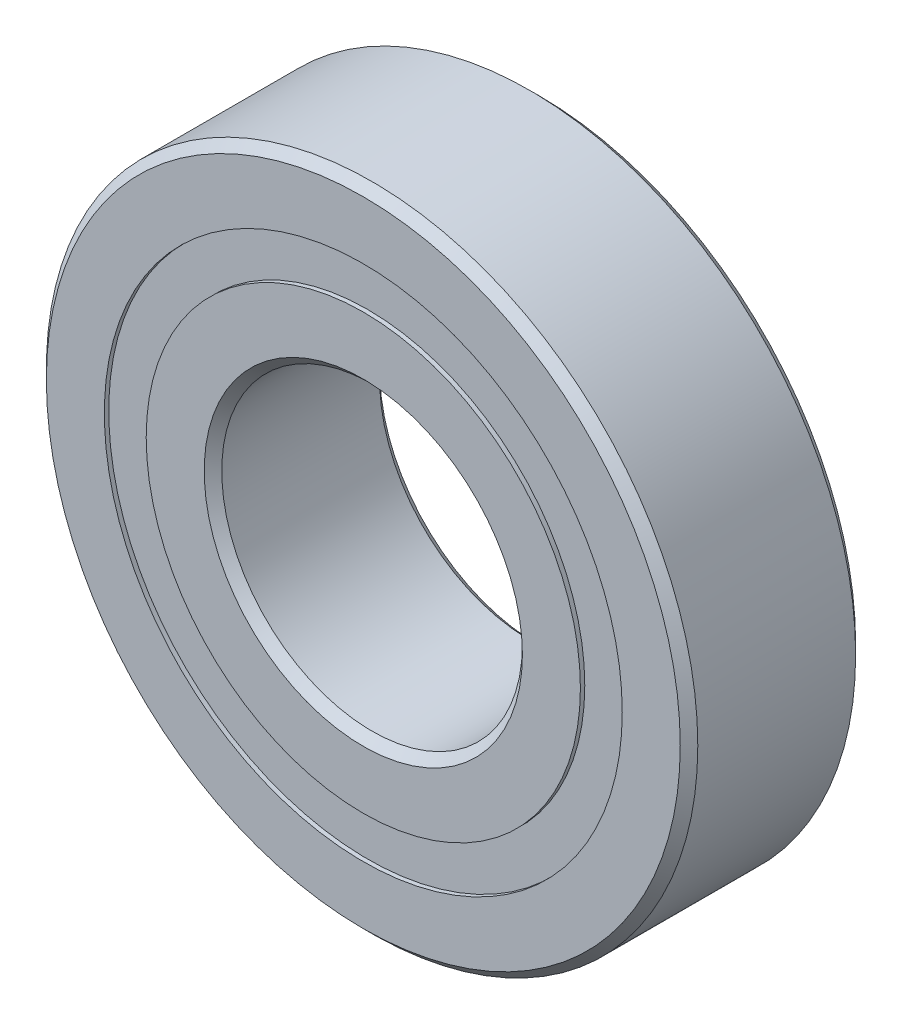
ISO-10303-21;
HEADER;
FILE_DESCRIPTION(('STEP AP214'),'2;1');
FILE_NAME('part.step','',(''),(''),'','','');
FILE_SCHEMA(('AUTOMOTIVE_DESIGN { 1 0 10303 214 1 1 1 1 }'));
ENDSEC;
DATA;
#1=APPLICATION_CONTEXT('core data for automotive mechanical design processes');
#2=APPLICATION_PROTOCOL_DEFINITION('international standard','automotive_design',2000,#1);
#3=PRODUCT_CONTEXT('',#1,'mechanical');
#4=PRODUCT('Part','Part','',(#3));
#5=PRODUCT_RELATED_PRODUCT_CATEGORY('part','',(#4));
#6=PRODUCT_DEFINITION_FORMATION('','',#4);
#7=PRODUCT_DEFINITION_CONTEXT('part definition',#1,'design');
#8=PRODUCT_DEFINITION('design','',#6,#7);
#9=PRODUCT_DEFINITION_SHAPE('','',#8);
#10=(LENGTH_UNIT() NAMED_UNIT(*) SI_UNIT(.MILLI.,.METRE.));
#11=(NAMED_UNIT(*) PLANE_ANGLE_UNIT() SI_UNIT($,.RADIAN.));
#12=(NAMED_UNIT(*) SI_UNIT($,.STERADIAN.) SOLID_ANGLE_UNIT());
#13=UNCERTAINTY_MEASURE_WITH_UNIT(LENGTH_MEASURE(1.E-05),#10,'distance_accuracy_value','');
#14=(GEOMETRIC_REPRESENTATION_CONTEXT(3) GLOBAL_UNCERTAINTY_ASSIGNED_CONTEXT((#13)) GLOBAL_UNIT_ASSIGNED_CONTEXT((#10,
#11,#12)) REPRESENTATION_CONTEXT('',''));
#15=CARTESIAN_POINT('',(0.,0.,0.));
#16=DIRECTION('',(0.,0.,1.));
#17=DIRECTION('',(1.,0.,0.));
#18=AXIS2_PLACEMENT_3D('',#15,#16,#17);
#19=CARTESIAN_POINT('',(0.,16.4070741758242,-5.2784375));
#20=DIRECTION('',(0.,0.,1.));
#21=DIRECTION('',(1.,0.,0.));
#22=AXIS2_PLACEMENT_3D('',#19,#20,#21);
#23=PLANE('',#22);
#24=CARTESIAN_POINT('',(0.,0.,-5.2784375));
#25=DIRECTION('',(0.,0.,1.));
#26=DIRECTION('',(1.,0.,0.));
#27=AXIS2_PLACEMENT_3D('',#24,#25,#26);
#28=CIRCLE('',#27,16.4070741758242);
#29=CARTESIAN_POINT('',(16.4070741758242,0.,-5.2784375));
#30=VERTEX_POINT('',#29);
#31=EDGE_CURVE('E72',#30,#30,#28,.T.);
#32=ORIENTED_EDGE('',*,*,#31,.F.);
#33=EDGE_LOOP('',(#32));
#34=FACE_BOUND('',#33,.T.);
#35=CARTESIAN_POINT('',(0.,0.,-5.2784375));
#36=DIRECTION('',(0.,0.,1.));
#37=DIRECTION('',(1.,0.,0.));
#38=AXIS2_PLACEMENT_3D('',#35,#36,#37);
#39=CIRCLE('',#38,13.7554258241758);
#40=CARTESIAN_POINT('',(13.7554258241758,0.,-5.2784375));
#41=VERTEX_POINT('',#40);
#42=EDGE_CURVE('E13',#41,#41,#39,.T.);
#43=ORIENTED_EDGE('',*,*,#42,.T.);
#44=EDGE_LOOP('',(#43));
#45=FACE_BOUND('',#44,.T.);
#46=ADVANCED_FACE('F58',(#34,#45),#23,.F.);
#47=CARTESIAN_POINT('',(0.,0.,5.55625));
#48=DIRECTION('',(0.,0.,1.));
#49=DIRECTION('',(1.,0.,0.));
#50=AXIS2_PLACEMENT_3D('',#47,#48,#49);
#51=CYLINDRICAL_SURFACE('',#50,13.7554258241758);
#52=ORIENTED_EDGE('',*,*,#42,.F.);
#53=EDGE_LOOP('',(#52));
#54=FACE_BOUND('',#53,.T.);
#55=CARTESIAN_POINT('',(0.,0.,-2.80284955168796));
#56=DIRECTION('',(0.,0.,1.));
#57=DIRECTION('',(1.,0.,0.));
#58=AXIS2_PLACEMENT_3D('',#55,#56,#57);
#59=CIRCLE('',#58,13.7554258241758);
#60=CARTESIAN_POINT('',(13.7554258241758,0.,-2.80284955168796));
#61=VERTEX_POINT('',#60);
#62=EDGE_CURVE('E64',#61,#61,#59,.T.);
#63=ORIENTED_EDGE('',*,*,#62,.T.);
#64=EDGE_LOOP('',(#63));
#65=FACE_BOUND('',#64,.T.);
#66=ADVANCED_FACE('F81',(#54,#65),#51,.F.);
#67=CARTESIAN_POINT('',(0.,16.4070741758242,-2.80284955168796));
#68=DIRECTION('',(0.,0.,-1.));
#69=DIRECTION('',(-1.,0.,0.));
#70=AXIS2_PLACEMENT_3D('',#67,#68,#69);
#71=PLANE('',#70);
#72=ORIENTED_EDGE('',*,*,#62,.F.);
#73=EDGE_LOOP('',(#72));
#74=FACE_BOUND('',#73,.T.);
#75=CARTESIAN_POINT('',(0.,0.,-2.80284955168796));
#76=DIRECTION('',(0.,0.,1.));
#77=DIRECTION('',(1.,0.,0.));
#78=AXIS2_PLACEMENT_3D('',#75,#76,#77);
#79=CIRCLE('',#78,16.4070741758242);
#80=CARTESIAN_POINT('',(16.4070741758242,0.,-2.80284955168796));
#81=VERTEX_POINT('',#80);
#82=EDGE_CURVE('E68',#81,#81,#79,.T.);
#83=ORIENTED_EDGE('',*,*,#82,.T.);
#84=EDGE_LOOP('',(#83));
#85=FACE_BOUND('',#84,.T.);
#86=ADVANCED_FACE('F85',(#74,#85),#71,.F.);
#87=CARTESIAN_POINT('',(0.,0.,5.55625));
#88=DIRECTION('',(0.,0.,1.));
#89=DIRECTION('',(1.,0.,0.));
#90=AXIS2_PLACEMENT_3D('',#87,#88,#89);
#91=CYLINDRICAL_SURFACE('',#90,16.4070741758242);
#92=ORIENTED_EDGE('',*,*,#82,.F.);
#93=EDGE_LOOP('',(#92));
#94=FACE_BOUND('',#93,.T.);
#95=ORIENTED_EDGE('',*,*,#31,.T.);
#96=EDGE_LOOP('',(#95));
#97=FACE_BOUND('',#96,.T.);
#98=ADVANCED_FACE('F78',(#94,#97),#91,.T.);
#99=CLOSED_SHELL('',(#46,#66,#86,#98));
#100=MANIFOLD_SOLID_BREP('B2',#99);
#101=CARTESIAN_POINT('',(0.,16.4070741758242,5.2784375));
#102=DIRECTION('',(0.,0.,-1.));
#103=DIRECTION('',(-1.,0.,0.));
#104=AXIS2_PLACEMENT_3D('',#101,#102,#103);
#105=PLANE('',#104);
#106=CARTESIAN_POINT('',(0.,0.,5.2784375));
#107=DIRECTION('',(0.,0.,1.));
#108=DIRECTION('',(1.,0.,0.));
#109=AXIS2_PLACEMENT_3D('',#106,#107,#108);
#110=CIRCLE('',#109,13.7554258241758);
#111=CARTESIAN_POINT('',(13.7554258241758,0.,5.2784375));
#112=VERTEX_POINT('',#111);
#113=EDGE_CURVE('E57',#112,#112,#110,.T.);
#114=ORIENTED_EDGE('',*,*,#113,.F.);
#115=EDGE_LOOP('',(#114));
#116=FACE_BOUND('',#115,.T.);
#117=CARTESIAN_POINT('',(0.,0.,5.2784375));
#118=DIRECTION('',(0.,0.,1.));
#119=DIRECTION('',(1.,0.,0.));
#120=AXIS2_PLACEMENT_3D('',#117,#118,#119);
#121=CIRCLE('',#120,16.4070741758242);
#122=CARTESIAN_POINT('',(16.4070741758242,0.,5.2784375));
#123=VERTEX_POINT('',#122);
#124=EDGE_CURVE('E147',#123,#123,#121,.T.);
#125=ORIENTED_EDGE('',*,*,#124,.T.);
#126=EDGE_LOOP('',(#125));
#127=FACE_BOUND('',#126,.T.);
#128=ADVANCED_FACE('F133',(#116,#127),#105,.F.);
#129=CARTESIAN_POINT('',(0.,0.,5.55625));
#130=DIRECTION('',(0.,0.,1.));
#131=DIRECTION('',(1.,0.,0.));
#132=AXIS2_PLACEMENT_3D('',#129,#130,#131);
#133=CYLINDRICAL_SURFACE('',#132,13.7554258241758);
#134=CARTESIAN_POINT('',(0.,0.,2.80284955168796));
#135=DIRECTION('',(0.,0.,1.));
#136=DIRECTION('',(1.,0.,0.));
#137=AXIS2_PLACEMENT_3D('',#134,#135,#136);
#138=CIRCLE('',#137,13.7554258241758);
#139=CARTESIAN_POINT('',(13.7554258241758,0.,2.80284955168796));
#140=VERTEX_POINT('',#139);
#141=EDGE_CURVE('E139',#140,#140,#138,.T.);
#142=ORIENTED_EDGE('',*,*,#141,.F.);
#143=EDGE_LOOP('',(#142));
#144=FACE_BOUND('',#143,.T.);
#145=ORIENTED_EDGE('',*,*,#113,.T.);
#146=EDGE_LOOP('',(#145));
#147=FACE_BOUND('',#146,.T.);
#148=ADVANCED_FACE('F162',(#144,#147),#133,.F.);
#149=CARTESIAN_POINT('',(0.,16.4070741758242,2.80284955168796));
#150=DIRECTION('',(0.,0.,1.));
#151=DIRECTION('',(1.,0.,0.));
#152=AXIS2_PLACEMENT_3D('',#149,#150,#151);
#153=PLANE('',#152);
#154=CARTESIAN_POINT('',(0.,0.,2.80284955168796));
#155=DIRECTION('',(0.,0.,1.));
#156=DIRECTION('',(1.,0.,0.));
#157=AXIS2_PLACEMENT_3D('',#154,#155,#156);
#158=CIRCLE('',#157,16.4070741758242);
#159=CARTESIAN_POINT('',(16.4070741758242,0.,2.80284955168796));
#160=VERTEX_POINT('',#159);
#161=EDGE_CURVE('E143',#160,#160,#158,.T.);
#162=ORIENTED_EDGE('',*,*,#161,.F.);
#163=EDGE_LOOP('',(#162));
#164=FACE_BOUND('',#163,.T.);
#165=ORIENTED_EDGE('',*,*,#141,.T.);
#166=EDGE_LOOP('',(#165));
#167=FACE_BOUND('',#166,.T.);
#168=ADVANCED_FACE('F157',(#164,#167),#153,.F.);
#169=CARTESIAN_POINT('',(0.,0.,5.55625));
#170=DIRECTION('',(0.,0.,1.));
#171=DIRECTION('',(1.,0.,0.));
#172=AXIS2_PLACEMENT_3D('',#169,#170,#171);
#173=CYLINDRICAL_SURFACE('',#172,16.4070741758242);
#174=ORIENTED_EDGE('',*,*,#124,.F.);
#175=EDGE_LOOP('',(#174));
#176=FACE_BOUND('',#175,.T.);
#177=ORIENTED_EDGE('',*,*,#161,.T.);
#178=EDGE_LOOP('',(#177));
#179=FACE_BOUND('',#178,.T.);
#180=ADVANCED_FACE('F154',(#176,#179),#173,.T.);
#181=CLOSED_SHELL('',(#128,#148,#168,#180));
#182=MANIFOLD_SOLID_BREP('B8',#181);
#183=CARTESIAN_POINT('',(-7.54062499999983,13.0607456208242,0.));
#184=DIRECTION('',(0.,0.,1.));
#185=DIRECTION('',(-0.499999999999989,0.866025403784445,0.));
#186=AXIS2_PLACEMENT_3D('',#183,#184,#185);
#187=SPHERICAL_SURFACE('',#186,2.80284955168796);
#188=CARTESIAN_POINT('',(-7.54062499999983,13.0607456208242,2.80284955168796));
#189=VERTEX_POINT('',#188);
#190=VERTEX_LOOP('',#189);
#191=FACE_BOUND('',#190,.T.);
#192=ADVANCED_FACE('F206',(#191),#187,.T.);
#193=CLOSED_SHELL('',(#192));
#194=MANIFOLD_SOLID_BREP('B52',#193);
#195=CARTESIAN_POINT('',(-13.060745620824,7.54062500000015,0.));
#196=DIRECTION('',(0.,0.,1.));
#197=DIRECTION('',(-0.866025403784433,0.50000000000001,0.));
#198=AXIS2_PLACEMENT_3D('',#195,#196,#197);
#199=SPHERICAL_SURFACE('',#198,2.80284955168796);
#200=CARTESIAN_POINT('',(-13.060745620824,7.54062500000015,2.80284955168796));
#201=VERTEX_POINT('',#200);
#202=VERTEX_LOOP('',#201);
#203=FACE_BOUND('',#202,.T.);
#204=ADVANCED_FACE('F232',(#203),#199,.T.);
#205=CLOSED_SHELL('',(#204));
#206=MANIFOLD_SOLID_BREP('B129',#205);
#207=CARTESIAN_POINT('',(-15.08125,1.57967708824284E-13,0.));
#208=DIRECTION('',(0.,0.,1.));
#209=DIRECTION('',(-1.,0.,0.));
#210=AXIS2_PLACEMENT_3D('',#207,#208,#209);
#211=SPHERICAL_SURFACE('',#210,2.80284955168796);
#212=CARTESIAN_POINT('',(-15.08125,1.57967708824284E-13,2.80284955168796));
#213=VERTEX_POINT('',#212);
#214=VERTEX_LOOP('',#213);
#215=FACE_BOUND('',#214,.T.);
#216=ADVANCED_FACE('F258',(#215),#211,.T.);
#217=CLOSED_SHELL('',(#216));
#218=MANIFOLD_SOLID_BREP('B202',#217);
#219=CARTESIAN_POINT('',(-13.0607456208241,-7.54062499999988,0.));
#220=DIRECTION('',(0.,0.,1.));
#221=DIRECTION('',(-0.866025403784443,-0.499999999999992,0.));
#222=AXIS2_PLACEMENT_3D('',#219,#220,#221);
#223=SPHERICAL_SURFACE('',#222,2.80284955168796);
#224=CARTESIAN_POINT('',(-13.0607456208241,-7.54062499999988,2.80284955168796));
#225=VERTEX_POINT('',#224);
#226=VERTEX_LOOP('',#225);
#227=FACE_BOUND('',#226,.T.);
#228=ADVANCED_FACE('F284',(#227),#223,.T.);
#229=CLOSED_SHELL('',(#228));
#230=MANIFOLD_SOLID_BREP('B228',#229);
#231=CARTESIAN_POINT('',(-7.54062500000011,-13.060745620824,0.));
#232=DIRECTION('',(0.,0.,1.));
#233=DIRECTION('',(-0.500000000000007,-0.866025403784435,0.));
#234=AXIS2_PLACEMENT_3D('',#231,#232,#233);
#235=SPHERICAL_SURFACE('',#234,2.80284955168796);
#236=CARTESIAN_POINT('',(-7.54062500000011,-13.060745620824,2.80284955168796));
#237=VERTEX_POINT('',#236);
#238=VERTEX_LOOP('',#237);
#239=FACE_BOUND('',#238,.T.);
#240=ADVANCED_FACE('F309',(#239),#235,.T.);
#241=CLOSED_SHELL('',(#240));
#242=MANIFOLD_SOLID_BREP('B254',#241);
#243=CARTESIAN_POINT('',(-1.05311805882856E-13,-15.08125,0.));
#244=DIRECTION('',(0.,0.,1.));
#245=DIRECTION('',(0.,-1.,0.));
#246=AXIS2_PLACEMENT_3D('',#243,#244,#245);
#247=SPHERICAL_SURFACE('',#246,2.80284955168796);
#248=CARTESIAN_POINT('',(-1.05311805882856E-13,-15.08125,2.80284955168796));
#249=VERTEX_POINT('',#248);
#250=VERTEX_LOOP('',#249);
#251=FACE_BOUND('',#250,.T.);
#252=ADVANCED_FACE('F335',(#251),#247,.T.);
#253=CLOSED_SHELL('',(#252));
#254=MANIFOLD_SOLID_BREP('B280',#253);
#255=CARTESIAN_POINT('',(7.54062499999992,-13.0607456208241,0.));
#256=DIRECTION('',(0.,0.,1.));
#257=DIRECTION('',(0.499999999999995,-0.866025403784442,0.));
#258=AXIS2_PLACEMENT_3D('',#255,#256,#257);
#259=SPHERICAL_SURFACE('',#258,2.80284955168796);
#260=CARTESIAN_POINT('',(7.54062499999992,-13.0607456208241,2.80284955168796));
#261=VERTEX_POINT('',#260);
#262=VERTEX_LOOP('',#261);
#263=FACE_BOUND('',#262,.T.);
#264=ADVANCED_FACE('F361',(#263),#259,.T.);
#265=CLOSED_SHELL('',(#264));
#266=MANIFOLD_SOLID_BREP('B305',#265);
#267=CARTESIAN_POINT('',(13.060745620824,-7.54062500000006,0.));
#268=DIRECTION('',(0.,0.,1.));
#269=DIRECTION('',(0.866025403784436,-0.500000000000004,0.));
#270=AXIS2_PLACEMENT_3D('',#267,#268,#269);
#271=SPHERICAL_SURFACE('',#270,2.80284955168796);
#272=CARTESIAN_POINT('',(13.060745620824,-7.54062500000006,2.80284955168796));
#273=VERTEX_POINT('',#272);
#274=VERTEX_LOOP('',#273);
#275=FACE_BOUND('',#274,.T.);
#276=ADVANCED_FACE('F387',(#275),#271,.T.);
#277=CLOSED_SHELL('',(#276));
#278=MANIFOLD_SOLID_BREP('B331',#277);
#279=CARTESIAN_POINT('',(15.08125,0.,0.));
#280=DIRECTION('',(0.,0.,1.));
#281=DIRECTION('',(1.,0.,0.));
#282=AXIS2_PLACEMENT_3D('',#279,#280,#281);
#283=SPHERICAL_SURFACE('',#282,2.80284955168796);
#284=CARTESIAN_POINT('',(15.08125,0.,2.80284955168796));
#285=VERTEX_POINT('',#284);
#286=VERTEX_LOOP('',#285);
#287=FACE_BOUND('',#286,.T.);
#288=ADVANCED_FACE('F412',(#287),#283,.T.);
#289=CLOSED_SHELL('',(#288));
#290=MANIFOLD_SOLID_BREP('B357',#289);
#291=CARTESIAN_POINT('',(13.0607456208241,7.54062499999997,0.));
#292=DIRECTION('',(0.,0.,1.));
#293=DIRECTION('',(0.86602540378444,0.499999999999998,0.));
#294=AXIS2_PLACEMENT_3D('',#291,#292,#293);
#295=SPHERICAL_SURFACE('',#294,2.80284955168796);
#296=CARTESIAN_POINT('',(13.0607456208241,7.54062499999997,2.80284955168796));
#297=VERTEX_POINT('',#296);
#298=VERTEX_LOOP('',#297);
#299=FACE_BOUND('',#298,.T.);
#300=ADVANCED_FACE('F438',(#299),#295,.T.);
#301=CLOSED_SHELL('',(#300));
#302=MANIFOLD_SOLID_BREP('B383',#301);
#303=CARTESIAN_POINT('',(7.54062500000002,13.0607456208241,0.));
#304=DIRECTION('',(0.,0.,1.));
#305=DIRECTION('',(0.500000000000001,0.866025403784438,0.));
#306=AXIS2_PLACEMENT_3D('',#303,#304,#305);
#307=SPHERICAL_SURFACE('',#306,2.80284955168796);
#308=CARTESIAN_POINT('',(7.54062500000002,13.0607456208241,2.80284955168796));
#309=VERTEX_POINT('',#308);
#310=VERTEX_LOOP('',#309);
#311=FACE_BOUND('',#310,.T.);
#312=ADVANCED_FACE('F463',(#311),#307,.T.);
#313=CLOSED_SHELL('',(#312));
#314=MANIFOLD_SOLID_BREP('B408',#313);
#315=CARTESIAN_POINT('',(0.,15.08125,0.));
#316=DIRECTION('',(0.,0.,1.));
#317=DIRECTION('',(0.,1.,0.));
#318=AXIS2_PLACEMENT_3D('',#315,#316,#317);
#319=SPHERICAL_SURFACE('',#318,2.80284955168796);
#320=CARTESIAN_POINT('',(0.,15.08125,2.80284955168796));
#321=VERTEX_POINT('',#320);
#322=VERTEX_LOOP('',#321);
#323=FACE_BOUND('',#322,.T.);
#324=ADVANCED_FACE('F492',(#323),#319,.T.);
#325=CLOSED_SHELL('',(#324));
#326=MANIFOLD_SOLID_BREP('B434',#325);
#327=CARTESIAN_POINT('',(0.,13.7554258241758,5.55625));
#328=DIRECTION('',(0.,0.,-1.));
#329=DIRECTION('',(-1.,0.,0.));
#330=AXIS2_PLACEMENT_3D('',#327,#328,#329);
#331=PLANE('',#330);
#332=CARTESIAN_POINT('',(0.,0.,5.55625));
#333=DIRECTION('',(0.,0.,1.));
#334=DIRECTION('',(1.,0.,0.));
#335=AXIS2_PLACEMENT_3D('',#332,#333,#334);
#336=CIRCLE('',#335,10.080625);
#337=CARTESIAN_POINT('',(10.080625,0.,5.55625));
#338=VERTEX_POINT('',#337);
#339=EDGE_CURVE('E548',#338,#338,#336,.T.);
#340=ORIENTED_EDGE('',*,*,#339,.F.);
#341=EDGE_LOOP('',(#340));
#342=FACE_BOUND('',#341,.T.);
#343=CARTESIAN_POINT('',(0.,0.,5.55625));
#344=DIRECTION('',(0.,0.,1.));
#345=DIRECTION('',(1.,0.,0.));
#346=AXIS2_PLACEMENT_3D('',#343,#344,#345);
#347=CIRCLE('',#346,13.7554258241758);
#348=CARTESIAN_POINT('',(13.7554258241758,0.,5.55625));
#349=VERTEX_POINT('',#348);
#350=EDGE_CURVE('E491',#349,#349,#347,.T.);
#351=ORIENTED_EDGE('',*,*,#350,.T.);
#352=EDGE_LOOP('',(#351));
#353=FACE_BOUND('',#352,.T.);
#354=ADVANCED_FACE('F520',(#342,#353),#331,.F.);
#355=CARTESIAN_POINT('',(0.,0.,5.55625));
#356=DIRECTION('',(0.,0.,1.));
#357=DIRECTION('',(1.,0.,0.));
#358=AXIS2_PLACEMENT_3D('',#355,#356,#357);
#359=CYLINDRICAL_SURFACE('',#358,13.7554258241758);
#360=ORIENTED_EDGE('',*,*,#350,.F.);
#361=EDGE_LOOP('',(#360));
#362=FACE_BOUND('',#361,.T.);
#363=CARTESIAN_POINT('',(0.,0.,2.46944444444444));
#364=DIRECTION('',(0.,0.,1.));
#365=DIRECTION('',(1.,0.,0.));
#366=AXIS2_PLACEMENT_3D('',#363,#364,#365);
#367=CIRCLE('',#366,13.7554258241758);
#368=CARTESIAN_POINT('',(13.7554258241758,0.,2.46944444444444));
#369=VERTEX_POINT('',#368);
#370=EDGE_CURVE('E526',#369,#369,#367,.T.);
#371=ORIENTED_EDGE('',*,*,#370,.T.);
#372=EDGE_LOOP('',(#371));
#373=FACE_BOUND('',#372,.T.);
#374=ADVANCED_FACE('F555',(#362,#373),#359,.T.);
#375=CARTESIAN_POINT('',(0.,0.,0.));
#376=DIRECTION('',(0.,0.,1.));
#377=DIRECTION('',(1.,0.,0.));
#378=AXIS2_PLACEMENT_3D('',#375,#376,#377);
#379=TOROIDAL_SURFACE('',#378,15.08125,2.80284955168795);
#380=ORIENTED_EDGE('',*,*,#370,.F.);
#381=EDGE_LOOP('',(#380));
#382=FACE_BOUND('',#381,.T.);
#383=CARTESIAN_POINT('',(0.,0.,-2.46944444444445));
#384=DIRECTION('',(0.,0.,1.));
#385=DIRECTION('',(1.,0.,0.));
#386=AXIS2_PLACEMENT_3D('',#383,#384,#385);
#387=CIRCLE('',#386,13.7554258241758);
#388=CARTESIAN_POINT('',(13.7554258241758,0.,-2.46944444444445));
#389=VERTEX_POINT('',#388);
#390=EDGE_CURVE('E530',#389,#389,#387,.T.);
#391=ORIENTED_EDGE('',*,*,#390,.T.);
#392=EDGE_LOOP('',(#391));
#393=FACE_BOUND('',#392,.T.);
#394=ADVANCED_FACE('F559',(#382,#393),#379,.F.);
#395=CARTESIAN_POINT('',(0.,0.,5.55625));
#396=DIRECTION('',(0.,0.,1.));
#397=DIRECTION('',(1.,0.,0.));
#398=AXIS2_PLACEMENT_3D('',#395,#396,#397);
#399=CYLINDRICAL_SURFACE('',#398,13.7554258241758);
#400=ORIENTED_EDGE('',*,*,#390,.F.);
#401=EDGE_LOOP('',(#400));
#402=FACE_BOUND('',#401,.T.);
#403=CARTESIAN_POINT('',(0.,0.,-5.55625));
#404=DIRECTION('',(0.,0.,1.));
#405=DIRECTION('',(1.,0.,0.));
#406=AXIS2_PLACEMENT_3D('',#403,#404,#405);
#407=CIRCLE('',#406,13.7554258241758);
#408=CARTESIAN_POINT('',(13.7554258241758,0.,-5.55625));
#409=VERTEX_POINT('',#408);
#410=EDGE_CURVE('E534',#409,#409,#407,.T.);
#411=ORIENTED_EDGE('',*,*,#410,.T.);
#412=EDGE_LOOP('',(#411));
#413=FACE_BOUND('',#412,.T.);
#414=ADVANCED_FACE('F564',(#402,#413),#399,.T.);
#415=CARTESIAN_POINT('',(0.,10.080625,-5.55625));
#416=DIRECTION('',(0.,0.,1.));
#417=DIRECTION('',(1.,0.,0.));
#418=AXIS2_PLACEMENT_3D('',#415,#416,#417);
#419=PLANE('',#418);
#420=ORIENTED_EDGE('',*,*,#410,.F.);
#421=EDGE_LOOP('',(#420));
#422=FACE_BOUND('',#421,.T.);
#423=CARTESIAN_POINT('',(0.,0.,-5.55625));
#424=DIRECTION('',(0.,0.,1.));
#425=DIRECTION('',(1.,0.,0.));
#426=AXIS2_PLACEMENT_3D('',#423,#424,#425);
#427=CIRCLE('',#426,10.080625);
#428=CARTESIAN_POINT('',(10.080625,0.,-5.55625));
#429=VERTEX_POINT('',#428);
#430=EDGE_CURVE('E539',#429,#429,#427,.T.);
#431=ORIENTED_EDGE('',*,*,#430,.T.);
#432=EDGE_LOOP('',(#431));
#433=FACE_BOUND('',#432,.T.);
#434=ADVANCED_FACE('F570',(#422,#433),#419,.F.);
#435=CARTESIAN_POINT('',(0.,0.,-5.000625));
#436=DIRECTION('',(0.,0.,-1.));
#437=DIRECTION('',(-1.,0.,0.));
#438=AXIS2_PLACEMENT_3D('',#435,#436,#437);
#439=CONICAL_SURFACE('',#438,9.525,0.78539816339745);
#440=ORIENTED_EDGE('',*,*,#430,.F.);
#441=EDGE_LOOP('',(#440));
#442=FACE_BOUND('',#441,.T.);
#443=CARTESIAN_POINT('',(0.,0.,-5.000625));
#444=DIRECTION('',(0.,0.,1.));
#445=DIRECTION('',(1.,0.,0.));
#446=AXIS2_PLACEMENT_3D('',#443,#444,#445);
#447=CIRCLE('',#446,9.525);
#448=CARTESIAN_POINT('',(9.525,0.,-5.000625));
#449=VERTEX_POINT('',#448);
#450=EDGE_CURVE('E542',#449,#449,#447,.T.);
#451=ORIENTED_EDGE('',*,*,#450,.T.);
#452=EDGE_LOOP('',(#451));
#453=FACE_BOUND('',#452,.T.);
#454=ADVANCED_FACE('F574',(#442,#453),#439,.F.);
#455=CARTESIAN_POINT('',(0.,0.,5.55625));
#456=DIRECTION('',(0.,0.,1.));
#457=DIRECTION('',(1.,0.,0.));
#458=AXIS2_PLACEMENT_3D('',#455,#456,#457);
#459=CYLINDRICAL_SURFACE('',#458,9.525);
#460=ORIENTED_EDGE('',*,*,#450,.F.);
#461=EDGE_LOOP('',(#460));
#462=FACE_BOUND('',#461,.T.);
#463=CARTESIAN_POINT('',(0.,0.,5.000625));
#464=DIRECTION('',(0.,0.,1.));
#465=DIRECTION('',(1.,0.,0.));
#466=AXIS2_PLACEMENT_3D('',#463,#464,#465);
#467=CIRCLE('',#466,9.525);
#468=CARTESIAN_POINT('',(9.525,0.,5.000625));
#469=VERTEX_POINT('',#468);
#470=EDGE_CURVE('E545',#469,#469,#467,.T.);
#471=ORIENTED_EDGE('',*,*,#470,.T.);
#472=EDGE_LOOP('',(#471));
#473=FACE_BOUND('',#472,.T.);
#474=ADVANCED_FACE('F578',(#462,#473),#459,.F.);
#475=CARTESIAN_POINT('',(0.,0.,5.55625));
#476=DIRECTION('',(0.,0.,1.));
#477=DIRECTION('',(1.,0.,0.));
#478=AXIS2_PLACEMENT_3D('',#475,#476,#477);
#479=CONICAL_SURFACE('',#478,10.080625,0.785398163397448);
#480=ORIENTED_EDGE('',*,*,#470,.F.);
#481=EDGE_LOOP('',(#480));
#482=FACE_BOUND('',#481,.T.);
#483=ORIENTED_EDGE('',*,*,#339,.T.);
#484=EDGE_LOOP('',(#483));
#485=FACE_BOUND('',#484,.T.);
#486=ADVANCED_FACE('F552',(#482,#485),#479,.F.);
#487=CLOSED_SHELL('',(#354,#374,#394,#414,#434,#454,#474,#486));
#488=MANIFOLD_SOLID_BREP('B459',#487);
#489=CARTESIAN_POINT('',(0.,0.,5.000625));
#490=DIRECTION('',(0.,0.,-1.));
#491=DIRECTION('',(-1.,0.,0.));
#492=AXIS2_PLACEMENT_3D('',#489,#490,#491);
#493=CONICAL_SURFACE('',#492,20.6375,0.785398163397446);
#494=CARTESIAN_POINT('',(0.,0.,5.55625));
#495=DIRECTION('',(0.,0.,1.));
#496=DIRECTION('',(1.,0.,0.));
#497=AXIS2_PLACEMENT_3D('',#494,#495,#496);
#498=CIRCLE('',#497,20.081875);
#499=CARTESIAN_POINT('',(20.081875,0.,5.55625));
#500=VERTEX_POINT('',#499);
#501=EDGE_CURVE('E676',#500,#500,#498,.T.);
#502=ORIENTED_EDGE('',*,*,#501,.F.);
#503=EDGE_LOOP('',(#502));
#504=FACE_BOUND('',#503,.T.);
#505=CARTESIAN_POINT('',(0.,0.,5.000625));
#506=DIRECTION('',(0.,0.,1.));
#507=DIRECTION('',(1.,0.,0.));
#508=AXIS2_PLACEMENT_3D('',#505,#506,#507);
#509=CIRCLE('',#508,20.6375);
#510=CARTESIAN_POINT('',(20.6375,0.,5.000625));
#511=VERTEX_POINT('',#510);
#512=EDGE_CURVE('E519',#511,#511,#509,.T.);
#513=ORIENTED_EDGE('',*,*,#512,.T.);
#514=EDGE_LOOP('',(#513));
#515=FACE_BOUND('',#514,.T.);
#516=ADVANCED_FACE('F648',(#504,#515),#493,.T.);
#517=CARTESIAN_POINT('',(0.,0.,5.55625));
#518=DIRECTION('',(0.,0.,1.));
#519=DIRECTION('',(1.,0.,0.));
#520=AXIS2_PLACEMENT_3D('',#517,#518,#519);
#521=CYLINDRICAL_SURFACE('',#520,20.6375);
#522=ORIENTED_EDGE('',*,*,#512,.F.);
#523=EDGE_LOOP('',(#522));
#524=FACE_BOUND('',#523,.T.);
#525=CARTESIAN_POINT('',(0.,0.,-5.000625));
#526=DIRECTION('',(0.,0.,1.));
#527=DIRECTION('',(1.,0.,0.));
#528=AXIS2_PLACEMENT_3D('',#525,#526,#527);
#529=CIRCLE('',#528,20.6375);
#530=CARTESIAN_POINT('',(20.6375,0.,-5.000625));
#531=VERTEX_POINT('',#530);
#532=EDGE_CURVE('E654',#531,#531,#529,.T.);
#533=ORIENTED_EDGE('',*,*,#532,.T.);
#534=EDGE_LOOP('',(#533));
#535=FACE_BOUND('',#534,.T.);
#536=ADVANCED_FACE('F683',(#524,#535),#521,.T.);
#537=CARTESIAN_POINT('',(0.,0.,-5.55625));
#538=DIRECTION('',(0.,0.,1.));
#539=DIRECTION('',(1.,0.,0.));
#540=AXIS2_PLACEMENT_3D('',#537,#538,#539);
#541=CONICAL_SURFACE('',#540,20.081875,0.785398163397447);
#542=ORIENTED_EDGE('',*,*,#532,.F.);
#543=EDGE_LOOP('',(#542));
#544=FACE_BOUND('',#543,.T.);
#545=CARTESIAN_POINT('',(0.,0.,-5.55625));
#546=DIRECTION('',(0.,0.,1.));
#547=DIRECTION('',(1.,0.,0.));
#548=AXIS2_PLACEMENT_3D('',#545,#546,#547);
#549=CIRCLE('',#548,20.081875);
#550=CARTESIAN_POINT('',(20.081875,0.,-5.55625));
#551=VERTEX_POINT('',#550);
#552=EDGE_CURVE('E658',#551,#551,#549,.T.);
#553=ORIENTED_EDGE('',*,*,#552,.T.);
#554=EDGE_LOOP('',(#553));
#555=FACE_BOUND('',#554,.T.);
#556=ADVANCED_FACE('F687',(#544,#555),#541,.T.);
#557=CARTESIAN_POINT('',(0.,20.081875,-5.55625));
#558=DIRECTION('',(0.,0.,1.));
#559=DIRECTION('',(1.,0.,0.));
#560=AXIS2_PLACEMENT_3D('',#557,#558,#559);
#561=PLANE('',#560);
#562=ORIENTED_EDGE('',*,*,#552,.F.);
#563=EDGE_LOOP('',(#562));
#564=FACE_BOUND('',#563,.T.);
#565=CARTESIAN_POINT('',(0.,0.,-5.55625));
#566=DIRECTION('',(0.,0.,1.));
#567=DIRECTION('',(1.,0.,0.));
#568=AXIS2_PLACEMENT_3D('',#565,#566,#567);
#569=CIRCLE('',#568,16.4070741758242);
#570=CARTESIAN_POINT('',(16.4070741758242,0.,-5.55625));
#571=VERTEX_POINT('',#570);
#572=EDGE_CURVE('E662',#571,#571,#569,.T.);
#573=ORIENTED_EDGE('',*,*,#572,.T.);
#574=EDGE_LOOP('',(#573));
#575=FACE_BOUND('',#574,.T.);
#576=ADVANCED_FACE('F692',(#564,#575),#561,.F.);
#577=CARTESIAN_POINT('',(0.,0.,5.55625));
#578=DIRECTION('',(0.,0.,1.));
#579=DIRECTION('',(1.,0.,0.));
#580=AXIS2_PLACEMENT_3D('',#577,#578,#579);
#581=CYLINDRICAL_SURFACE('',#580,16.4070741758242);
#582=ORIENTED_EDGE('',*,*,#572,.F.);
#583=EDGE_LOOP('',(#582));
#584=FACE_BOUND('',#583,.T.);
#585=CARTESIAN_POINT('',(0.,0.,-2.46944444444444));
#586=DIRECTION('',(0.,0.,1.));
#587=DIRECTION('',(1.,0.,0.));
#588=AXIS2_PLACEMENT_3D('',#585,#586,#587);
#589=CIRCLE('',#588,16.4070741758242);
#590=CARTESIAN_POINT('',(16.4070741758242,0.,-2.46944444444444));
#591=VERTEX_POINT('',#590);
#592=EDGE_CURVE('E667',#591,#591,#589,.T.);
#593=ORIENTED_EDGE('',*,*,#592,.T.);
#594=EDGE_LOOP('',(#593));
#595=FACE_BOUND('',#594,.T.);
#596=ADVANCED_FACE('F698',(#584,#595),#581,.F.);
#597=CARTESIAN_POINT('',(0.,0.,0.));
#598=DIRECTION('',(0.,0.,1.));
#599=DIRECTION('',(1.,0.,0.));
#600=AXIS2_PLACEMENT_3D('',#597,#598,#599);
#601=TOROIDAL_SURFACE('',#600,15.08125,2.80284955168796);
#602=ORIENTED_EDGE('',*,*,#592,.F.);
#603=EDGE_LOOP('',(#602));
#604=FACE_BOUND('',#603,.T.);
#605=CARTESIAN_POINT('',(0.,0.,2.46944444444444));
#606=DIRECTION('',(0.,0.,1.));
#607=DIRECTION('',(1.,0.,0.));
#608=AXIS2_PLACEMENT_3D('',#605,#606,#607);
#609=CIRCLE('',#608,16.4070741758242);
#610=CARTESIAN_POINT('',(16.4070741758242,0.,2.46944444444444));
#611=VERTEX_POINT('',#610);
#612=EDGE_CURVE('E670',#611,#611,#609,.T.);
#613=ORIENTED_EDGE('',*,*,#612,.T.);
#614=EDGE_LOOP('',(#613));
#615=FACE_BOUND('',#614,.T.);
#616=ADVANCED_FACE('F702',(#604,#615),#601,.F.);
#617=CARTESIAN_POINT('',(0.,0.,5.55625));
#618=DIRECTION('',(0.,0.,1.));
#619=DIRECTION('',(1.,0.,0.));
#620=AXIS2_PLACEMENT_3D('',#617,#618,#619);
#621=CYLINDRICAL_SURFACE('',#620,16.4070741758242);
#622=ORIENTED_EDGE('',*,*,#612,.F.);
#623=EDGE_LOOP('',(#622));
#624=FACE_BOUND('',#623,.T.);
#625=CARTESIAN_POINT('',(0.,0.,5.55625));
#626=DIRECTION('',(0.,0.,1.));
#627=DIRECTION('',(1.,0.,0.));
#628=AXIS2_PLACEMENT_3D('',#625,#626,#627);
#629=CIRCLE('',#628,16.4070741758242);
#630=CARTESIAN_POINT('',(16.4070741758242,0.,5.55625));
#631=VERTEX_POINT('',#630);
#632=EDGE_CURVE('E673',#631,#631,#629,.T.);
#633=ORIENTED_EDGE('',*,*,#632,.T.);
#634=EDGE_LOOP('',(#633));
#635=FACE_BOUND('',#634,.T.);
#636=ADVANCED_FACE('F706',(#624,#635),#621,.F.);
#637=CARTESIAN_POINT('',(0.,20.081875,5.55625));
#638=DIRECTION('',(0.,0.,-1.));
#639=DIRECTION('',(-1.,0.,0.));
#640=AXIS2_PLACEMENT_3D('',#637,#638,#639);
#641=PLANE('',#640);
#642=ORIENTED_EDGE('',*,*,#632,.F.);
#643=EDGE_LOOP('',(#642));
#644=FACE_BOUND('',#643,.T.);
#645=ORIENTED_EDGE('',*,*,#501,.T.);
#646=EDGE_LOOP('',(#645));
#647=FACE_BOUND('',#646,.T.);
#648=ADVANCED_FACE('F680',(#644,#647),#641,.F.);
#649=CLOSED_SHELL('',(#516,#536,#556,#576,#596,#616,#636,#648));
#650=MANIFOLD_SOLID_BREP('B486',#649);
#651=ADVANCED_BREP_SHAPE_REPRESENTATION('',(#18,#100,#182,#194,#206,#218,#230,#242,#254,#266,
#278,#290,#302,#314,#326,#488,#650),#14);
#652=SHAPE_DEFINITION_REPRESENTATION(#9,#651);
ENDSEC;
END-ISO-10303-21;
